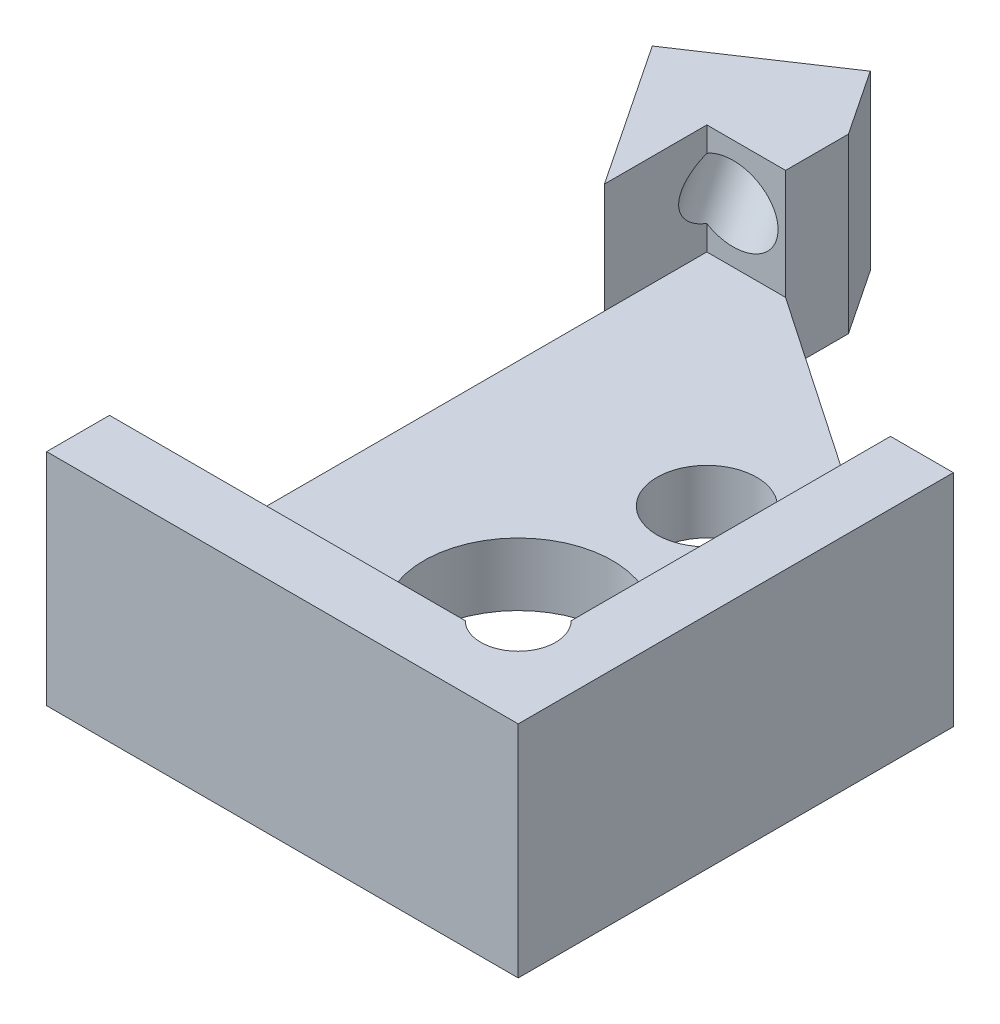
ISO-10303-21;
HEADER;
FILE_DESCRIPTION(('STEP AP214'),'2;1');
FILE_NAME('part.step','',(''),(''),'','','');
FILE_SCHEMA(('AUTOMOTIVE_DESIGN { 1 0 10303 214 1 1 1 1 }'));
ENDSEC;
DATA;
#1=APPLICATION_CONTEXT('core data for automotive mechanical design processes');
#2=APPLICATION_PROTOCOL_DEFINITION('international standard','automotive_design',2000,#1);
#3=PRODUCT_CONTEXT('',#1,'mechanical');
#4=PRODUCT('Part','Part','',(#3));
#5=PRODUCT_RELATED_PRODUCT_CATEGORY('part','',(#4));
#6=PRODUCT_DEFINITION_FORMATION('','',#4);
#7=PRODUCT_DEFINITION_CONTEXT('part definition',#1,'design');
#8=PRODUCT_DEFINITION('design','',#6,#7);
#9=PRODUCT_DEFINITION_SHAPE('','',#8);
#10=(LENGTH_UNIT() NAMED_UNIT(*) SI_UNIT(.MILLI.,.METRE.));
#11=(NAMED_UNIT(*) PLANE_ANGLE_UNIT() SI_UNIT($,.RADIAN.));
#12=(NAMED_UNIT(*) SI_UNIT($,.STERADIAN.) SOLID_ANGLE_UNIT());
#13=UNCERTAINTY_MEASURE_WITH_UNIT(LENGTH_MEASURE(1.E-05),#10,'distance_accuracy_value','');
#14=(GEOMETRIC_REPRESENTATION_CONTEXT(3) GLOBAL_UNCERTAINTY_ASSIGNED_CONTEXT((#13)) GLOBAL_UNIT_ASSIGNED_CONTEXT((#10,
#11,#12)) REPRESENTATION_CONTEXT('',''));
#15=CARTESIAN_POINT('',(0.,0.,0.));
#16=DIRECTION('',(0.,0.,1.));
#17=DIRECTION('',(1.,0.,0.));
#18=AXIS2_PLACEMENT_3D('',#15,#16,#17);
#19=CARTESIAN_POINT('',(4.25,3.5,5.75));
#20=DIRECTION('',(0.,0.,-1.));
#21=DIRECTION('',(-1.,0.,0.));
#22=AXIS2_PLACEMENT_3D('',#19,#20,#21);
#23=PLANE('',#22);
#24=DIRECTION('',(1.,0.,0.));
#25=VECTOR('',#24,1.);
#26=CARTESIAN_POINT('',(4.25,3.5,5.75));
#27=LINE('',#26,#25);
#28=CARTESIAN_POINT('',(-3.25,3.5,5.75));
#29=VERTEX_POINT('',#28);
#30=CARTESIAN_POINT('',(4.25,3.5,5.75));
#31=VERTEX_POINT('',#30);
#32=EDGE_CURVE('E281',#29,#31,#27,.T.);
#33=ORIENTED_EDGE('',*,*,#32,.F.);
#34=DIRECTION('',(0.,1.,0.));
#35=VECTOR('',#34,1.);
#36=CARTESIAN_POINT('',(-3.25,-0.001000000000001,5.75));
#37=LINE('',#36,#35);
#38=CARTESIAN_POINT('',(-3.25,0.,5.75));
#39=VERTEX_POINT('',#38);
#40=EDGE_CURVE('E172',#39,#29,#37,.T.);
#41=ORIENTED_EDGE('',*,*,#40,.F.);
#42=DIRECTION('',(1.,0.,0.));
#43=VECTOR('',#42,1.);
#44=CARTESIAN_POINT('',(4.25,0.,5.75));
#45=LINE('',#44,#43);
#46=CARTESIAN_POINT('',(4.25,0.,5.75));
#47=VERTEX_POINT('',#46);
#48=EDGE_CURVE('E169',#39,#47,#45,.T.);
#49=ORIENTED_EDGE('',*,*,#48,.T.);
#50=DIRECTION('',(0.,-1.,0.));
#51=VECTOR('',#50,1.);
#52=CARTESIAN_POINT('',(4.25,3.5,5.75));
#53=LINE('',#52,#51);
#54=EDGE_CURVE('E287',#31,#47,#53,.T.);
#55=ORIENTED_EDGE('',*,*,#54,.F.);
#56=EDGE_LOOP('',(#33,#41,#49,#55));
#57=FACE_BOUND('',#56,.T.);
#58=ADVANCED_FACE('F35',(#57),#23,.F.);
#59=CARTESIAN_POINT('',(4.25,3.5,-5.75));
#60=DIRECTION('',(-1.,0.,0.));
#61=DIRECTION('',(0.,0.,1.));
#62=AXIS2_PLACEMENT_3D('',#59,#60,#61);
#63=PLANE('',#62);
#64=DIRECTION('',(0.,0.,-1.));
#65=VECTOR('',#64,1.);
#66=CARTESIAN_POINT('',(4.25,0.,-5.75));
#67=LINE('',#66,#65);
#68=CARTESIAN_POINT('',(4.25,0.,-1.17080631760558));
#69=VERTEX_POINT('',#68);
#70=EDGE_CURVE('E284',#47,#69,#67,.T.);
#71=ORIENTED_EDGE('',*,*,#70,.T.);
#72=DIRECTION('',(0.,1.,0.));
#73=VECTOR('',#72,1.);
#74=CARTESIAN_POINT('',(4.25,-0.001000000000001,-1.17080631760558));
#75=LINE('',#74,#73);
#76=CARTESIAN_POINT('',(4.25,3.5,-1.17080631760558));
#77=VERTEX_POINT('',#76);
#78=EDGE_CURVE('E191',#69,#77,#75,.T.);
#79=ORIENTED_EDGE('',*,*,#78,.T.);
#80=DIRECTION('',(0.,0.,-1.));
#81=VECTOR('',#80,1.);
#82=CARTESIAN_POINT('',(4.25,3.5,-5.75));
#83=LINE('',#82,#81);
#84=EDGE_CURVE('E283',#31,#77,#83,.T.);
#85=ORIENTED_EDGE('',*,*,#84,.F.);
#86=ORIENTED_EDGE('',*,*,#54,.T.);
#87=EDGE_LOOP('',(#71,#79,#85,#86));
#88=FACE_BOUND('',#87,.T.);
#89=ADVANCED_FACE('F320',(#88),#63,.F.);
#90=CARTESIAN_POINT('',(0.,3.5,0.));
#91=DIRECTION('',(0.,-1.,0.));
#92=DIRECTION('',(0.,0.,-1.));
#93=AXIS2_PLACEMENT_3D('',#90,#91,#92);
#94=PLANE('',#93);
#95=DIRECTION('',(1.,0.,0.));
#96=VECTOR('',#95,1.);
#97=CARTESIAN_POINT('',(3.25,3.5,4.75));
#98=LINE('',#97,#96);
#99=CARTESIAN_POINT('',(-3.25,3.5,4.75));
#100=VERTEX_POINT('',#99);
#101=CARTESIAN_POINT('',(2.40810098864977,3.5,4.75));
#102=VERTEX_POINT('',#101);
#103=EDGE_CURVE('E255',#100,#102,#98,.T.);
#104=ORIENTED_EDGE('',*,*,#103,.F.);
#105=DIRECTION('',(0.,0.,-1.));
#106=VECTOR('',#105,1.);
#107=CARTESIAN_POINT('',(-3.25,3.5,-3.12166032803723));
#108=LINE('',#107,#106);
#109=EDGE_CURVE('E170',#29,#100,#108,.T.);
#110=ORIENTED_EDGE('',*,*,#109,.F.);
#111=ORIENTED_EDGE('',*,*,#32,.T.);
#112=ORIENTED_EDGE('',*,*,#84,.T.);
#113=DIRECTION('',(1.,0.,0.));
#114=VECTOR('',#113,1.);
#115=CARTESIAN_POINT('',(3.25,3.5,-1.17080631760558));
#116=LINE('',#115,#114);
#117=CARTESIAN_POINT('',(3.25,3.5,-1.17080631760558));
#118=VERTEX_POINT('',#117);
#119=EDGE_CURVE('E188',#118,#77,#116,.T.);
#120=ORIENTED_EDGE('',*,*,#119,.F.);
#121=DIRECTION('',(0.,0.,-1.));
#122=VECTOR('',#121,1.);
#123=CARTESIAN_POINT('',(3.25,3.5,-4.75));
#124=LINE('',#123,#122);
#125=CARTESIAN_POINT('',(3.25,3.5,3.90810098864977));
#126=VERTEX_POINT('',#125);
#127=EDGE_CURVE('E258',#126,#118,#124,.T.);
#128=ORIENTED_EDGE('',*,*,#127,.F.);
#129=CARTESIAN_POINT('',(2.82905049432488,3.5,4.32905049432488));
#130=DIRECTION('',(0.,1.,0.));
#131=DIRECTION('',(0.,0.,1.));
#132=AXIS2_PLACEMENT_3D('',#129,#130,#131);
#133=CIRCLE('',#132,0.595312500000001);
#134=EDGE_CURVE('E242',#102,#126,#133,.T.);
#135=ORIENTED_EDGE('',*,*,#134,.F.);
#136=EDGE_LOOP('',(#104,#110,#111,#112,#120,#128,#135));
#137=FACE_BOUND('',#136,.T.);
#138=ADVANCED_FACE('F328',(#137),#94,.F.);
#139=CARTESIAN_POINT('',(0.,0.,0.));
#140=DIRECTION('',(0.,-1.,0.));
#141=DIRECTION('',(0.,0.,-1.));
#142=AXIS2_PLACEMENT_3D('',#139,#140,#141);
#143=PLANE('',#142);
#144=DIRECTION('',(0.,0.,-1.));
#145=VECTOR('',#144,1.);
#146=CARTESIAN_POINT('',(-3.25,0.,-3.12166032803723));
#147=LINE('',#146,#145);
#148=CARTESIAN_POINT('',(-3.25,0.,-3.12166032803723));
#149=VERTEX_POINT('',#148);
#150=EDGE_CURVE('E159',#39,#149,#147,.T.);
#151=ORIENTED_EDGE('',*,*,#150,.T.);
#152=DIRECTION('',(0.55470019622523,0.,0.832050294337843));
#153=VECTOR('',#152,1.);
#154=CARTESIAN_POINT('',(-4.00154138705974,0.,-4.24897240862684));
#155=LINE('',#154,#153);
#156=CARTESIAN_POINT('',(-4.77077215629051,0.,-5.40281856247299));
#157=VERTEX_POINT('',#156);
#158=EDGE_CURVE('E145',#157,#149,#155,.T.);
#159=ORIENTED_EDGE('',*,*,#158,.F.);
#160=DIRECTION('',(-0.832050294337844,0.,0.554700196225229));
#161=VECTOR('',#160,1.);
#162=CARTESIAN_POINT('',(-2.6906464204459,0.,-6.78956905303607));
#163=LINE('',#162,#161);
#164=CARTESIAN_POINT('',(-2.6906464204459,0.,-6.78956905303607));
#165=VERTEX_POINT('',#164);
#166=EDGE_CURVE('E217',#165,#157,#163,.T.);
#167=ORIENTED_EDGE('',*,*,#166,.F.);
#168=DIRECTION('',(-0.554700196225229,0.,-0.832050294337844));
#169=VECTOR('',#168,1.);
#170=CARTESIAN_POINT('',(-2.6906464204459,0.,-6.78956905303607));
#171=LINE('',#170,#169);
#172=CARTESIAN_POINT('',(-1.99760038508853,0.,-5.75));
#173=VERTEX_POINT('',#172);
#174=EDGE_CURVE('E155',#173,#165,#171,.T.);
#175=ORIENTED_EDGE('',*,*,#174,.F.);
#176=DIRECTION('',(0.,0.,1.));
#177=VECTOR('',#176,1.);
#178=CARTESIAN_POINT('',(-1.99760038508852,0.,-5.75));
#179=LINE('',#178,#177);
#180=CARTESIAN_POINT('',(-1.99760038508852,0.,-4.75));
#181=VERTEX_POINT('',#180);
#182=EDGE_CURVE('E199',#173,#181,#179,.T.);
#183=ORIENTED_EDGE('',*,*,#182,.T.);
#184=DIRECTION('',(0.826133221814283,0.,0.563474843994613));
#185=VECTOR('',#184,1.);
#186=CARTESIAN_POINT('',(-1.99760038508852,0.,-4.75));
#187=LINE('',#186,#185);
#188=CARTESIAN_POINT('',(3.25,0.,-1.17080631760558));
#189=VERTEX_POINT('',#188);
#190=EDGE_CURVE('E182',#181,#189,#187,.T.);
#191=ORIENTED_EDGE('',*,*,#190,.T.);
#192=DIRECTION('',(1.,0.,0.));
#193=VECTOR('',#192,1.);
#194=CARTESIAN_POINT('',(3.25,0.,-1.17080631760558));
#195=LINE('',#194,#193);
#196=EDGE_CURVE('E185',#189,#69,#195,.T.);
#197=ORIENTED_EDGE('',*,*,#196,.T.);
#198=ORIENTED_EDGE('',*,*,#70,.F.);
#199=ORIENTED_EDGE('',*,*,#48,.F.);
#200=EDGE_LOOP('',(#151,#159,#167,#175,#183,#191,#197,#198,#199));
#201=FACE_BOUND('',#200,.T.);
#202=CARTESIAN_POINT('',(2.125,0.,3.5));
#203=DIRECTION('',(0.,1.,0.));
#204=DIRECTION('',(0.,0.,1.));
#205=AXIS2_PLACEMENT_3D('',#202,#203,#204);
#206=CIRCLE('',#205,0.79375);
#207=CARTESIAN_POINT('',(2.125,0.,4.29375));
#208=VERTEX_POINT('',#207);
#209=EDGE_CURVE('E227',#208,#208,#206,.T.);
#210=ORIENTED_EDGE('',*,*,#209,.T.);
#211=EDGE_LOOP('',(#210));
#212=FACE_BOUND('',#211,.T.);
#213=CARTESIAN_POINT('',(-1.625,0.,3.5));
#214=DIRECTION('',(0.,1.,0.));
#215=DIRECTION('',(0.,0.,1.));
#216=AXIS2_PLACEMENT_3D('',#213,#214,#215);
#217=CIRCLE('',#216,0.793750000000001);
#218=CARTESIAN_POINT('',(-1.625,0.,4.29375));
#219=VERTEX_POINT('',#218);
#220=EDGE_CURVE('E233',#219,#219,#217,.T.);
#221=ORIENTED_EDGE('',*,*,#220,.T.);
#222=EDGE_LOOP('',(#221));
#223=FACE_BOUND('',#222,.T.);
#224=CARTESIAN_POINT('',(0.250000000000001,0.,-1.25));
#225=DIRECTION('',(0.,1.,0.));
#226=DIRECTION('',(0.,0.,1.));
#227=AXIS2_PLACEMENT_3D('',#224,#225,#226);
#228=CIRCLE('',#227,0.79375);
#229=CARTESIAN_POINT('',(0.250000000000001,0.,-0.456249999999999));
#230=VERTEX_POINT('',#229);
#231=EDGE_CURVE('E239',#230,#230,#228,.T.);
#232=ORIENTED_EDGE('',*,*,#231,.T.);
#233=EDGE_LOOP('',(#232));
#234=FACE_BOUND('',#233,.T.);
#235=CARTESIAN_POINT('',(0.250000000000001,0.,1.75));
#236=DIRECTION('',(0.,1.,0.));
#237=DIRECTION('',(0.,0.,1.));
#238=AXIS2_PLACEMENT_3D('',#235,#236,#237);
#239=CIRCLE('',#238,1.5);
#240=CARTESIAN_POINT('',(0.250000000000001,0.,3.25));
#241=VERTEX_POINT('',#240);
#242=EDGE_CURVE('E252',#241,#241,#239,.T.);
#243=ORIENTED_EDGE('',*,*,#242,.T.);
#244=EDGE_LOOP('',(#243));
#245=FACE_BOUND('',#244,.T.);
#246=ADVANCED_FACE('F166',(#201,#212,#223,#234,#245),#143,.T.);
#247=CARTESIAN_POINT('',(0.,1.,0.));
#248=DIRECTION('',(0.,-1.,0.));
#249=DIRECTION('',(0.,0.,-1.));
#250=AXIS2_PLACEMENT_3D('',#247,#248,#249);
#251=PLANE('',#250);
#252=CARTESIAN_POINT('',(2.125,1.,3.5));
#253=DIRECTION('',(0.,1.,0.));
#254=DIRECTION('',(0.,0.,1.));
#255=AXIS2_PLACEMENT_3D('',#252,#253,#254);
#256=CIRCLE('',#255,0.79375);
#257=CARTESIAN_POINT('',(2.125,1.,4.29375));
#258=VERTEX_POINT('',#257);
#259=EDGE_CURVE('E226',#258,#258,#256,.T.);
#260=ORIENTED_EDGE('',*,*,#259,.F.);
#261=EDGE_LOOP('',(#260));
#262=FACE_BOUND('',#261,.T.);
#263=CARTESIAN_POINT('',(-1.625,1.,3.5));
#264=DIRECTION('',(0.,1.,0.));
#265=DIRECTION('',(0.,0.,1.));
#266=AXIS2_PLACEMENT_3D('',#263,#264,#265);
#267=CIRCLE('',#266,0.793750000000001);
#268=CARTESIAN_POINT('',(-1.625,1.,4.29375));
#269=VERTEX_POINT('',#268);
#270=EDGE_CURVE('E230',#269,#269,#267,.T.);
#271=ORIENTED_EDGE('',*,*,#270,.F.);
#272=EDGE_LOOP('',(#271));
#273=FACE_BOUND('',#272,.T.);
#274=CARTESIAN_POINT('',(0.250000000000001,1.,-1.25));
#275=DIRECTION('',(0.,1.,0.));
#276=DIRECTION('',(0.,0.,1.));
#277=AXIS2_PLACEMENT_3D('',#274,#275,#276);
#278=CIRCLE('',#277,0.79375);
#279=CARTESIAN_POINT('',(0.250000000000001,1.,-0.456249999999999));
#280=VERTEX_POINT('',#279);
#281=EDGE_CURVE('E236',#280,#280,#278,.T.);
#282=ORIENTED_EDGE('',*,*,#281,.F.);
#283=EDGE_LOOP('',(#282));
#284=FACE_BOUND('',#283,.T.);
#285=CARTESIAN_POINT('',(0.250000000000001,1.,1.75));
#286=DIRECTION('',(0.,1.,0.));
#287=DIRECTION('',(0.,0.,1.));
#288=AXIS2_PLACEMENT_3D('',#285,#286,#287);
#289=CIRCLE('',#288,1.5);
#290=CARTESIAN_POINT('',(0.250000000000001,1.,3.25));
#291=VERTEX_POINT('',#290);
#292=EDGE_CURVE('E251',#291,#291,#289,.T.);
#293=ORIENTED_EDGE('',*,*,#292,.F.);
#294=EDGE_LOOP('',(#293));
#295=FACE_BOUND('',#294,.T.);
#296=DIRECTION('',(0.,0.,-1.));
#297=VECTOR('',#296,1.);
#298=CARTESIAN_POINT('',(3.25,1.,-4.75));
#299=LINE('',#298,#297);
#300=CARTESIAN_POINT('',(3.25,1.,3.90810098864977));
#301=VERTEX_POINT('',#300);
#302=CARTESIAN_POINT('',(3.25,1.,-1.17080631760558));
#303=VERTEX_POINT('',#302);
#304=EDGE_CURVE('E266',#301,#303,#299,.T.);
#305=ORIENTED_EDGE('',*,*,#304,.T.);
#306=DIRECTION('',(0.826133221814283,0.,0.563474843994613));
#307=VECTOR('',#306,1.);
#308=CARTESIAN_POINT('',(-1.99760038508852,1.,-4.75));
#309=LINE('',#308,#307);
#310=CARTESIAN_POINT('',(-1.99760038508852,1.,-4.75));
#311=VERTEX_POINT('',#310);
#312=EDGE_CURVE('E202',#311,#303,#309,.T.);
#313=ORIENTED_EDGE('',*,*,#312,.F.);
#314=DIRECTION('',(-1.,0.,0.));
#315=VECTOR('',#314,1.);
#316=CARTESIAN_POINT('',(3.25,1.,-4.75));
#317=LINE('',#316,#315);
#318=CARTESIAN_POINT('',(-3.25,1.,-4.75));
#319=VERTEX_POINT('',#318);
#320=EDGE_CURVE('E272',#311,#319,#317,.T.);
#321=ORIENTED_EDGE('',*,*,#320,.T.);
#322=DIRECTION('',(0.,0.,1.));
#323=VECTOR('',#322,1.);
#324=CARTESIAN_POINT('',(-3.25,1.,-4.75));
#325=LINE('',#324,#323);
#326=CARTESIAN_POINT('',(-3.25,1.,-3.12166032803723));
#327=VERTEX_POINT('',#326);
#328=EDGE_CURVE('E267',#319,#327,#325,.T.);
#329=ORIENTED_EDGE('',*,*,#328,.T.);
#330=DIRECTION('',(0.,0.,1.));
#331=VECTOR('',#330,1.);
#332=CARTESIAN_POINT('',(-3.25,1.,0.));
#333=LINE('',#332,#331);
#334=CARTESIAN_POINT('',(-3.25,0.999999999999999,4.75));
#335=VERTEX_POINT('',#334);
#336=EDGE_CURVE('E162',#327,#335,#333,.T.);
#337=ORIENTED_EDGE('',*,*,#336,.T.);
#338=DIRECTION('',(1.,0.,0.));
#339=VECTOR('',#338,1.);
#340=CARTESIAN_POINT('',(3.25,1.,4.75));
#341=LINE('',#340,#339);
#342=CARTESIAN_POINT('',(2.40810098864977,1.,4.75));
#343=VERTEX_POINT('',#342);
#344=EDGE_CURVE('E261',#335,#343,#341,.T.);
#345=ORIENTED_EDGE('',*,*,#344,.T.);
#346=CARTESIAN_POINT('',(2.82905049432488,1.,4.32905049432488));
#347=DIRECTION('',(0.,-1.,0.));
#348=DIRECTION('',(0.,0.,-1.));
#349=AXIS2_PLACEMENT_3D('',#346,#347,#348);
#350=CIRCLE('',#349,0.595312500000001);
#351=EDGE_CURVE('E246',#343,#301,#350,.F.);
#352=ORIENTED_EDGE('',*,*,#351,.T.);
#353=EDGE_LOOP('',(#305,#313,#321,#329,#337,#345,#352));
#354=FACE_BOUND('',#353,.T.);
#355=ADVANCED_FACE('F335',(#262,#273,#284,#295,#354),#251,.F.);
#356=CARTESIAN_POINT('',(3.25,-11.5108644332213,4.75));
#357=DIRECTION('',(0.,0.,1.));
#358=DIRECTION('',(1.,0.,0.));
#359=AXIS2_PLACEMENT_3D('',#356,#357,#358);
#360=PLANE('',#359);
#361=ORIENTED_EDGE('',*,*,#103,.T.);
#362=DIRECTION('',(0.,1.,0.));
#363=VECTOR('',#362,1.);
#364=CARTESIAN_POINT('',(2.40810098864977,-0.68379802270047,4.75));
#365=LINE('',#364,#363);
#366=EDGE_CURVE('E248',#102,#343,#365,.F.);
#367=ORIENTED_EDGE('',*,*,#366,.T.);
#368=ORIENTED_EDGE('',*,*,#344,.F.);
#369=DIRECTION('',(0.,1.,0.));
#370=VECTOR('',#369,1.);
#371=CARTESIAN_POINT('',(-3.25,-11.5108644332213,4.75));
#372=LINE('',#371,#370);
#373=EDGE_CURVE('E270',#335,#100,#372,.T.);
#374=ORIENTED_EDGE('',*,*,#373,.T.);
#375=EDGE_LOOP('',(#361,#367,#368,#374));
#376=FACE_BOUND('',#375,.T.);
#377=ADVANCED_FACE('F332',(#376),#360,.F.);
#378=CARTESIAN_POINT('',(3.25,-11.5108644332213,-4.75));
#379=DIRECTION('',(1.,0.,0.));
#380=DIRECTION('',(0.,0.,-1.));
#381=AXIS2_PLACEMENT_3D('',#378,#379,#380);
#382=PLANE('',#381);
#383=ORIENTED_EDGE('',*,*,#127,.T.);
#384=DIRECTION('',(0.,1.,0.));
#385=VECTOR('',#384,1.);
#386=CARTESIAN_POINT('',(3.25,-0.001000000000001,-1.17080631760558));
#387=LINE('',#386,#385);
#388=EDGE_CURVE('E180',#303,#118,#387,.T.);
#389=ORIENTED_EDGE('',*,*,#388,.F.);
#390=ORIENTED_EDGE('',*,*,#304,.F.);
#391=DIRECTION('',(0.,1.,0.));
#392=VECTOR('',#391,1.);
#393=CARTESIAN_POINT('',(3.25,-0.68379802270047,3.90810098864977));
#394=LINE('',#393,#392);
#395=EDGE_CURVE('E293',#301,#126,#394,.T.);
#396=ORIENTED_EDGE('',*,*,#395,.T.);
#397=EDGE_LOOP('',(#383,#389,#390,#396));
#398=FACE_BOUND('',#397,.T.);
#399=ADVANCED_FACE('F372',(#398),#382,.F.);
#400=CARTESIAN_POINT('',(3.25,-11.5108644332213,-4.75));
#401=DIRECTION('',(0.,0.,-1.));
#402=DIRECTION('',(-1.,0.,0.));
#403=AXIS2_PLACEMENT_3D('',#400,#401,#402);
#404=PLANE('',#403);
#405=ORIENTED_EDGE('',*,*,#320,.F.);
#406=DIRECTION('',(0.,-1.,0.));
#407=VECTOR('',#406,1.);
#408=CARTESIAN_POINT('',(-1.99760038508852,-0.001000000000001,-4.75));
#409=LINE('',#408,#407);
#410=CARTESIAN_POINT('',(-1.99760038508852,2.75,-4.75));
#411=VERTEX_POINT('',#410);
#412=EDGE_CURVE('E177',#411,#311,#409,.T.);
#413=ORIENTED_EDGE('',*,*,#412,.F.);
#414=DIRECTION('',(-1.,0.,0.));
#415=VECTOR('',#414,1.);
#416=CARTESIAN_POINT('',(3.25,2.75,-4.75));
#417=LINE('',#416,#415);
#418=CARTESIAN_POINT('',(-3.25,2.75,-4.75));
#419=VERTEX_POINT('',#418);
#420=EDGE_CURVE('E215',#411,#419,#417,.T.);
#421=ORIENTED_EDGE('',*,*,#420,.T.);
#422=DIRECTION('',(0.,1.,0.));
#423=VECTOR('',#422,1.);
#424=CARTESIAN_POINT('',(-3.25,-11.5108644332213,-4.75));
#425=LINE('',#424,#423);
#426=CARTESIAN_POINT('',(-3.25,2.35928589904809,-4.75));
#427=VERTEX_POINT('',#426);
#428=EDGE_CURVE('E274',#427,#419,#425,.T.);
#429=ORIENTED_EDGE('',*,*,#428,.F.);
#430=CARTESIAN_POINT('',(-2.83324674986519,1.875,-4.75));
#431=DIRECTION('',(0.,0.,-1.));
#432=DIRECTION('',(-1.,0.,0.));
#433=AXIS2_PLACEMENT_3D('',#430,#431,#432);
#434=ELLIPSE('',#433,0.715858168734871,0.595629999999999);
#435=CARTESIAN_POINT('',(-3.25,1.39071410095191,-4.75));
#436=VERTEX_POINT('',#435);
#437=EDGE_CURVE('E56',#427,#436,#434,.T.);
#438=ORIENTED_EDGE('',*,*,#437,.T.);
#439=EDGE_CURVE('E271',#319,#436,#425,.T.);
#440=ORIENTED_EDGE('',*,*,#439,.F.);
#441=EDGE_LOOP('',(#405,#413,#421,#429,#438,#440));
#442=FACE_BOUND('',#441,.T.);
#443=ADVANCED_FACE('F342',(#442),#404,.F.);
#444=CARTESIAN_POINT('',(-3.25,-11.5108644332213,-4.75));
#445=DIRECTION('',(-1.,0.,0.));
#446=DIRECTION('',(0.,0.,1.));
#447=AXIS2_PLACEMENT_3D('',#444,#445,#446);
#448=PLANE('',#447);
#449=DIRECTION('',(0.,0.,1.));
#450=VECTOR('',#449,1.);
#451=CARTESIAN_POINT('',(-3.25,2.75,-4.75));
#452=LINE('',#451,#450);
#453=CARTESIAN_POINT('',(-3.25,2.75,-3.12166032803723));
#454=VERTEX_POINT('',#453);
#455=EDGE_CURVE('E212',#419,#454,#452,.T.);
#456=ORIENTED_EDGE('',*,*,#455,.T.);
#457=DIRECTION('',(0.,1.,0.));
#458=VECTOR('',#457,1.);
#459=CARTESIAN_POINT('',(-3.25,-0.001000000000001,-3.12166032803723));
#460=LINE('',#459,#458);
#461=EDGE_CURVE('E163',#327,#454,#460,.T.);
#462=ORIENTED_EDGE('',*,*,#461,.F.);
#463=ORIENTED_EDGE('',*,*,#328,.F.);
#464=ORIENTED_EDGE('',*,*,#439,.T.);
#465=CARTESIAN_POINT('',(-3.25,1.875,-5.37512987520222));
#466=DIRECTION('',(-1.,0.,0.));
#467=DIRECTION('',(0.,0.,-1.));
#468=AXIS2_PLACEMENT_3D('',#465,#466,#467);
#469=ELLIPSE('',#468,1.0737872531023,0.595629999999999);
#470=EDGE_CURVE('E13',#436,#427,#469,.T.);
#471=ORIENTED_EDGE('',*,*,#470,.T.);
#472=ORIENTED_EDGE('',*,*,#428,.T.);
#473=EDGE_LOOP('',(#456,#462,#463,#464,#471,#472));
#474=FACE_BOUND('',#473,.T.);
#475=ADVANCED_FACE('F340',(#474),#448,.F.);
#476=CARTESIAN_POINT('',(0.250000000000001,0.,1.75));
#477=DIRECTION('',(0.,1.,0.));
#478=DIRECTION('',(0.,0.,1.));
#479=AXIS2_PLACEMENT_3D('',#476,#477,#478);
#480=CYLINDRICAL_SURFACE('',#479,1.5);
#481=ORIENTED_EDGE('',*,*,#242,.F.);
#482=EDGE_LOOP('',(#481));
#483=FACE_BOUND('',#482,.T.);
#484=ORIENTED_EDGE('',*,*,#292,.T.);
#485=EDGE_LOOP('',(#484));
#486=FACE_BOUND('',#485,.T.);
#487=ADVANCED_FACE('F380',(#483,#486),#480,.F.);
#488=CARTESIAN_POINT('',(2.82905049432488,-0.68379802270047,4.32905049432488));
#489=DIRECTION('',(0.,1.,0.));
#490=DIRECTION('',(0.,0.,1.));
#491=AXIS2_PLACEMENT_3D('',#488,#489,#490);
#492=CYLINDRICAL_SURFACE('',#491,0.595312500000001);
#493=ORIENTED_EDGE('',*,*,#134,.T.);
#494=ORIENTED_EDGE('',*,*,#395,.F.);
#495=ORIENTED_EDGE('',*,*,#351,.F.);
#496=ORIENTED_EDGE('',*,*,#366,.F.);
#497=EDGE_LOOP('',(#493,#494,#495,#496));
#498=FACE_BOUND('',#497,.T.);
#499=ADVANCED_FACE('F383',(#498),#492,.F.);
#500=CARTESIAN_POINT('',(0.250000000000001,0.,-1.25));
#501=DIRECTION('',(0.,1.,0.));
#502=DIRECTION('',(0.,0.,1.));
#503=AXIS2_PLACEMENT_3D('',#500,#501,#502);
#504=CYLINDRICAL_SURFACE('',#503,0.79375);
#505=ORIENTED_EDGE('',*,*,#231,.F.);
#506=EDGE_LOOP('',(#505));
#507=FACE_BOUND('',#506,.T.);
#508=ORIENTED_EDGE('',*,*,#281,.T.);
#509=EDGE_LOOP('',(#508));
#510=FACE_BOUND('',#509,.T.);
#511=ADVANCED_FACE('F387',(#507,#510),#504,.F.);
#512=CARTESIAN_POINT('',(-1.625,0.,3.5));
#513=DIRECTION('',(0.,1.,0.));
#514=DIRECTION('',(0.,0.,1.));
#515=AXIS2_PLACEMENT_3D('',#512,#513,#514);
#516=CYLINDRICAL_SURFACE('',#515,0.793750000000001);
#517=ORIENTED_EDGE('',*,*,#220,.F.);
#518=EDGE_LOOP('',(#517));
#519=FACE_BOUND('',#518,.T.);
#520=ORIENTED_EDGE('',*,*,#270,.T.);
#521=EDGE_LOOP('',(#520));
#522=FACE_BOUND('',#521,.T.);
#523=ADVANCED_FACE('F391',(#519,#522),#516,.F.);
#524=CARTESIAN_POINT('',(2.125,0.,3.5));
#525=DIRECTION('',(0.,1.,0.));
#526=DIRECTION('',(0.,0.,1.));
#527=AXIS2_PLACEMENT_3D('',#524,#525,#526);
#528=CYLINDRICAL_SURFACE('',#527,0.79375);
#529=ORIENTED_EDGE('',*,*,#209,.F.);
#530=EDGE_LOOP('',(#529));
#531=FACE_BOUND('',#530,.T.);
#532=ORIENTED_EDGE('',*,*,#259,.T.);
#533=EDGE_LOOP('',(#532));
#534=FACE_BOUND('',#533,.T.);
#535=ADVANCED_FACE('F395',(#531,#534),#528,.F.);
#536=CARTESIAN_POINT('',(-2.6906464204459,-3.81752063551709,-6.78956905303607));
#537=DIRECTION('',(-0.554700196225229,0.,-0.832050294337843));
#538=DIRECTION('',(-0.832050294337844,0.,0.554700196225229));
#539=AXIS2_PLACEMENT_3D('',#536,#537,#538);
#540=PLANE('',#539);
#541=CARTESIAN_POINT('',(-3.73070928836821,1.875,-6.09619380775453));
#542=DIRECTION('',(-0.55470019622523,0.,-0.832050294337843));
#543=DIRECTION('',(-0.832050294337843,0.,0.55470019622523));
#544=AXIS2_PLACEMENT_3D('',#541,#542,#543);
#545=CIRCLE('',#544,0.595629999999999);
#546=CARTESIAN_POINT('',(-4.22630340518466,1.875,-5.7657977298769));
#547=VERTEX_POINT('',#546);
#548=EDGE_CURVE('E205',#547,#547,#545,.T.);
#549=ORIENTED_EDGE('',*,*,#548,.F.);
#550=EDGE_LOOP('',(#549));
#551=FACE_BOUND('',#550,.T.);
#552=DIRECTION('',(-0.832050294337844,0.,0.554700196225229));
#553=VECTOR('',#552,1.);
#554=CARTESIAN_POINT('',(-2.6906464204459,2.75,-6.78956905303607));
#555=LINE('',#554,#553);
#556=CARTESIAN_POINT('',(-2.6906464204459,2.75,-6.78956905303607));
#557=VERTEX_POINT('',#556);
#558=CARTESIAN_POINT('',(-4.77077215629051,2.75,-5.40281856247299));
#559=VERTEX_POINT('',#558);
#560=EDGE_CURVE('E209',#557,#559,#555,.T.);
#561=ORIENTED_EDGE('',*,*,#560,.F.);
#562=DIRECTION('',(0.,1.,0.));
#563=VECTOR('',#562,1.);
#564=CARTESIAN_POINT('',(-2.6906464204459,-3.81752063551709,-6.78956905303607));
#565=LINE('',#564,#563);
#566=EDGE_CURVE('E219',#165,#557,#565,.T.);
#567=ORIENTED_EDGE('',*,*,#566,.F.);
#568=ORIENTED_EDGE('',*,*,#166,.T.);
#569=DIRECTION('',(0.,1.,0.));
#570=VECTOR('',#569,1.);
#571=CARTESIAN_POINT('',(-4.77077215629051,-3.81752063551709,-5.40281856247299));
#572=LINE('',#571,#570);
#573=EDGE_CURVE('E151',#157,#559,#572,.T.);
#574=ORIENTED_EDGE('',*,*,#573,.T.);
#575=EDGE_LOOP('',(#561,#567,#568,#574));
#576=FACE_BOUND('',#575,.T.);
#577=ADVANCED_FACE('F304',(#551,#576),#540,.T.);
#578=CARTESIAN_POINT('',(-4.00154138705974,-3.81752063551709,-4.24897240862684));
#579=DIRECTION('',(-0.832050294337843,0.,0.55470019622523));
#580=DIRECTION('',(0.55470019622523,0.,0.832050294337843));
#581=AXIS2_PLACEMENT_3D('',#578,#579,#580);
#582=PLANE('',#581);
#583=DIRECTION('',(0.55470019622523,0.,0.832050294337843));
#584=VECTOR('',#583,1.);
#585=CARTESIAN_POINT('',(-4.00154138705974,2.75,-4.24897240862684));
#586=LINE('',#585,#584);
#587=EDGE_CURVE('E49',#559,#454,#586,.T.);
#588=ORIENTED_EDGE('',*,*,#587,.F.);
#589=ORIENTED_EDGE('',*,*,#573,.F.);
#590=ORIENTED_EDGE('',*,*,#158,.T.);
#591=EDGE_CURVE('E148',#149,#327,#460,.T.);
#592=ORIENTED_EDGE('',*,*,#591,.T.);
#593=ORIENTED_EDGE('',*,*,#461,.T.);
#594=EDGE_LOOP('',(#588,#589,#590,#592,#593));
#595=FACE_BOUND('',#594,.T.);
#596=ADVANCED_FACE('F147',(#595),#582,.T.);
#597=CARTESIAN_POINT('',(-2.6906464204459,-3.81752063551709,-6.78956905303607));
#598=DIRECTION('',(0.832050294337844,0.,-0.554700196225229));
#599=DIRECTION('',(-0.554700196225229,0.,-0.832050294337844));
#600=AXIS2_PLACEMENT_3D('',#597,#598,#599);
#601=PLANE('',#600);
#602=DIRECTION('',(-0.554700196225229,0.,-0.832050294337844));
#603=VECTOR('',#602,1.);
#604=CARTESIAN_POINT('',(-2.6906464204459,2.75,-6.78956905303607));
#605=LINE('',#604,#603);
#606=CARTESIAN_POINT('',(-1.99760038508853,2.75,-5.75));
#607=VERTEX_POINT('',#606);
#608=EDGE_CURVE('E42',#607,#557,#605,.T.);
#609=ORIENTED_EDGE('',*,*,#608,.F.);
#610=DIRECTION('',(0.,1.,0.));
#611=VECTOR('',#610,1.);
#612=CARTESIAN_POINT('',(-1.99760038508853,3.5,-5.75));
#613=LINE('',#612,#611);
#614=EDGE_CURVE('E224',#173,#607,#613,.T.);
#615=ORIENTED_EDGE('',*,*,#614,.F.);
#616=ORIENTED_EDGE('',*,*,#174,.T.);
#617=ORIENTED_EDGE('',*,*,#566,.T.);
#618=EDGE_LOOP('',(#609,#615,#616,#617));
#619=FACE_BOUND('',#618,.T.);
#620=ADVANCED_FACE('F305',(#619),#601,.T.);
#621=CARTESIAN_POINT('',(0.,2.75,0.));
#622=DIRECTION('',(0.,-1.,0.));
#623=DIRECTION('',(0.,0.,-1.));
#624=AXIS2_PLACEMENT_3D('',#621,#622,#623);
#625=PLANE('',#624);
#626=ORIENTED_EDGE('',*,*,#587,.T.);
#627=ORIENTED_EDGE('',*,*,#455,.F.);
#628=ORIENTED_EDGE('',*,*,#420,.F.);
#629=DIRECTION('',(0.,0.,1.));
#630=VECTOR('',#629,1.);
#631=CARTESIAN_POINT('',(-1.99760038508852,2.75,-5.75));
#632=LINE('',#631,#630);
#633=EDGE_CURVE('E194',#607,#411,#632,.T.);
#634=ORIENTED_EDGE('',*,*,#633,.F.);
#635=ORIENTED_EDGE('',*,*,#608,.T.);
#636=ORIENTED_EDGE('',*,*,#560,.T.);
#637=EDGE_LOOP('',(#626,#627,#628,#634,#635,#636));
#638=FACE_BOUND('',#637,.T.);
#639=ADVANCED_FACE('F298',(#638),#625,.F.);
#640=CARTESIAN_POINT('',(-3.73070928836821,1.875,-6.09619380775453));
#641=DIRECTION('',(-0.55470019622523,0.,-0.832050294337843));
#642=DIRECTION('',(-0.832050294337843,0.,0.55470019622523));
#643=AXIS2_PLACEMENT_3D('',#640,#641,#642);
#644=CYLINDRICAL_SURFACE('',#643,0.595629999999999);
#645=ORIENTED_EDGE('',*,*,#548,.T.);
#646=EDGE_LOOP('',(#645));
#647=FACE_BOUND('',#646,.T.);
#648=ORIENTED_EDGE('',*,*,#470,.F.);
#649=ORIENTED_EDGE('',*,*,#437,.F.);
#650=EDGE_LOOP('',(#648,#649));
#651=FACE_BOUND('',#650,.T.);
#652=ADVANCED_FACE('F345',(#647,#651),#644,.F.);
#653=CARTESIAN_POINT('',(-1.99760038508852,-0.001000000000001,-4.75));
#654=DIRECTION('',(-0.563474843994613,0.,0.826133221814283));
#655=DIRECTION('',(0.826133221814283,0.,0.563474843994613));
#656=AXIS2_PLACEMENT_3D('',#653,#654,#655);
#657=PLANE('',#656);
#658=DIRECTION('',(0.,1.,0.));
#659=VECTOR('',#658,1.);
#660=CARTESIAN_POINT('',(-1.99760038508852,-0.001000000000001,-4.75));
#661=LINE('',#660,#659);
#662=EDGE_CURVE('E190',#181,#311,#661,.T.);
#663=ORIENTED_EDGE('',*,*,#662,.T.);
#664=ORIENTED_EDGE('',*,*,#312,.T.);
#665=DIRECTION('',(0.,1.,0.));
#666=VECTOR('',#665,1.);
#667=CARTESIAN_POINT('',(3.25,-0.001000000000001,-1.17080631760558));
#668=LINE('',#667,#666);
#669=EDGE_CURVE('E195',#189,#303,#668,.T.);
#670=ORIENTED_EDGE('',*,*,#669,.F.);
#671=ORIENTED_EDGE('',*,*,#190,.F.);
#672=EDGE_LOOP('',(#663,#664,#670,#671));
#673=FACE_BOUND('',#672,.T.);
#674=ADVANCED_FACE('F313',(#673),#657,.F.);
#675=CARTESIAN_POINT('',(-1.99760038508852,-0.001000000000001,-5.75));
#676=DIRECTION('',(-1.,0.,0.));
#677=DIRECTION('',(0.,0.,1.));
#678=AXIS2_PLACEMENT_3D('',#675,#676,#677);
#679=PLANE('',#678);
#680=ORIENTED_EDGE('',*,*,#614,.T.);
#681=ORIENTED_EDGE('',*,*,#633,.T.);
#682=ORIENTED_EDGE('',*,*,#412,.T.);
#683=ORIENTED_EDGE('',*,*,#662,.F.);
#684=ORIENTED_EDGE('',*,*,#182,.F.);
#685=EDGE_LOOP('',(#680,#681,#682,#683,#684));
#686=FACE_BOUND('',#685,.T.);
#687=ADVANCED_FACE('F309',(#686),#679,.F.);
#688=CARTESIAN_POINT('',(3.25,-0.001000000000001,-1.17080631760558));
#689=DIRECTION('',(0.,0.,1.));
#690=DIRECTION('',(1.,0.,0.));
#691=AXIS2_PLACEMENT_3D('',#688,#689,#690);
#692=PLANE('',#691);
#693=ORIENTED_EDGE('',*,*,#669,.T.);
#694=ORIENTED_EDGE('',*,*,#388,.T.);
#695=ORIENTED_EDGE('',*,*,#119,.T.);
#696=ORIENTED_EDGE('',*,*,#78,.F.);
#697=ORIENTED_EDGE('',*,*,#196,.F.);
#698=EDGE_LOOP('',(#693,#694,#695,#696,#697));
#699=FACE_BOUND('',#698,.T.);
#700=ADVANCED_FACE('F317',(#699),#692,.F.);
#701=CARTESIAN_POINT('',(-3.25,-0.001000000000001,-3.12166032803723));
#702=DIRECTION('',(1.,0.,0.));
#703=DIRECTION('',(0.,0.,-1.));
#704=AXIS2_PLACEMENT_3D('',#701,#702,#703);
#705=PLANE('',#704);
#706=ORIENTED_EDGE('',*,*,#591,.F.);
#707=ORIENTED_EDGE('',*,*,#150,.F.);
#708=ORIENTED_EDGE('',*,*,#40,.T.);
#709=ORIENTED_EDGE('',*,*,#109,.T.);
#710=ORIENTED_EDGE('',*,*,#373,.F.);
#711=ORIENTED_EDGE('',*,*,#336,.F.);
#712=EDGE_LOOP('',(#706,#707,#708,#709,#710,#711));
#713=FACE_BOUND('',#712,.T.);
#714=ADVANCED_FACE('F158',(#713),#705,.F.);
#715=CLOSED_SHELL('',(#58,#89,#138,#246,#355,#377,#399,#443,#475,#487,#499,#511,#523,#535,#577,
#596,#620,#639,#652,#674,#687,#700,#714));
#716=MANIFOLD_SOLID_BREP('B2',#715);
#717=ADVANCED_BREP_SHAPE_REPRESENTATION('',(#18,#716),#14);
#718=SHAPE_DEFINITION_REPRESENTATION(#9,#717);
ENDSEC;
END-ISO-10303-21;
